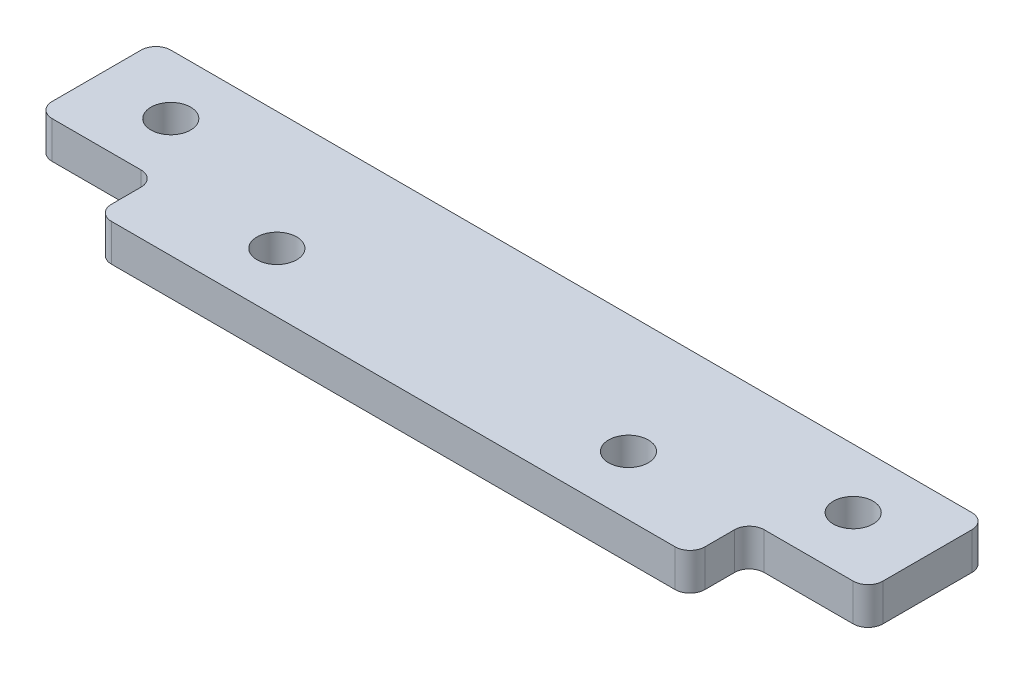
ISO-10303-21;
HEADER;
FILE_DESCRIPTION(('STEP AP214'),'2;1');
FILE_NAME('part.step','',(''),(''),'','','');
FILE_SCHEMA(('AUTOMOTIVE_DESIGN { 1 0 10303 214 1 1 1 1 }'));
ENDSEC;
DATA;
#1=APPLICATION_CONTEXT('core data for automotive mechanical design processes');
#2=APPLICATION_PROTOCOL_DEFINITION('international standard','automotive_design',2000,#1);
#3=PRODUCT_CONTEXT('',#1,'mechanical');
#4=PRODUCT('Part','Part','',(#3));
#5=PRODUCT_RELATED_PRODUCT_CATEGORY('part','',(#4));
#6=PRODUCT_DEFINITION_FORMATION('','',#4);
#7=PRODUCT_DEFINITION_CONTEXT('part definition',#1,'design');
#8=PRODUCT_DEFINITION('design','',#6,#7);
#9=PRODUCT_DEFINITION_SHAPE('','',#8);
#10=(LENGTH_UNIT() NAMED_UNIT(*) SI_UNIT(.MILLI.,.METRE.));
#11=(NAMED_UNIT(*) PLANE_ANGLE_UNIT() SI_UNIT($,.RADIAN.));
#12=(NAMED_UNIT(*) SI_UNIT($,.STERADIAN.) SOLID_ANGLE_UNIT());
#13=UNCERTAINTY_MEASURE_WITH_UNIT(LENGTH_MEASURE(1.E-05),#10,'distance_accuracy_value','');
#14=(GEOMETRIC_REPRESENTATION_CONTEXT(3) GLOBAL_UNCERTAINTY_ASSIGNED_CONTEXT((#13)) GLOBAL_UNIT_ASSIGNED_CONTEXT((#10,
#11,#12)) REPRESENTATION_CONTEXT('',''));
#15=CARTESIAN_POINT('',(0.,0.,0.));
#16=DIRECTION('',(0.,0.,1.));
#17=DIRECTION('',(1.,0.,0.));
#18=AXIS2_PLACEMENT_3D('',#15,#16,#17);
#19=CARTESIAN_POINT('',(0.,3.175,0.));
#20=DIRECTION('',(1.,0.,0.));
#21=DIRECTION('',(0.,0.,-1.));
#22=AXIS2_PLACEMENT_3D('',#19,#20,#21);
#23=PLANE('',#22);
#24=DIRECTION('',(0.,0.,1.));
#25=VECTOR('',#24,1.);
#26=CARTESIAN_POINT('',(0.,3.175,0.));
#27=LINE('',#26,#25);
#28=CARTESIAN_POINT('',(0.,3.175,-3.81));
#29=VERTEX_POINT('',#28);
#30=CARTESIAN_POINT('',(0.,3.175,-1.27));
#31=VERTEX_POINT('',#30);
#32=EDGE_CURVE('E185',#29,#31,#27,.T.);
#33=ORIENTED_EDGE('',*,*,#32,.F.);
#34=DIRECTION('',(0.,-1.,0.));
#35=VECTOR('',#34,1.);
#36=CARTESIAN_POINT('',(0.,0.,-3.81));
#37=LINE('',#36,#35);
#38=CARTESIAN_POINT('',(0.,0.,-3.81));
#39=VERTEX_POINT('',#38);
#40=EDGE_CURVE('E235',#29,#39,#37,.T.);
#41=ORIENTED_EDGE('',*,*,#40,.T.);
#42=DIRECTION('',(0.,0.,1.));
#43=VECTOR('',#42,1.);
#44=CARTESIAN_POINT('',(0.,0.,0.));
#45=LINE('',#44,#43);
#46=CARTESIAN_POINT('',(0.,0.,-1.27));
#47=VERTEX_POINT('',#46);
#48=EDGE_CURVE('E244',#39,#47,#45,.T.);
#49=ORIENTED_EDGE('',*,*,#48,.T.);
#50=DIRECTION('',(0.,-1.,0.));
#51=VECTOR('',#50,1.);
#52=CARTESIAN_POINT('',(0.,3.175,-1.27));
#53=LINE('',#52,#51);
#54=EDGE_CURVE('E233',#47,#31,#53,.F.);
#55=ORIENTED_EDGE('',*,*,#54,.T.);
#56=EDGE_LOOP('',(#33,#41,#49,#55));
#57=FACE_BOUND('',#56,.T.);
#58=ADVANCED_FACE('F33',(#57),#23,.F.);
#59=CARTESIAN_POINT('',(0.,3.175,0.));
#60=DIRECTION('',(0.,0.,-1.));
#61=DIRECTION('',(-1.,0.,0.));
#62=AXIS2_PLACEMENT_3D('',#59,#60,#61);
#63=PLANE('',#62);
#64=DIRECTION('',(1.,0.,0.));
#65=VECTOR('',#64,1.);
#66=CARTESIAN_POINT('',(0.,0.,0.));
#67=LINE('',#66,#65);
#68=CARTESIAN_POINT('',(1.27,0.,0.));
#69=VERTEX_POINT('',#68);
#70=CARTESIAN_POINT('',(49.53,0.,0.));
#71=VERTEX_POINT('',#70);
#72=EDGE_CURVE('E279',#69,#71,#67,.T.);
#73=ORIENTED_EDGE('',*,*,#72,.T.);
#74=DIRECTION('',(0.,-1.,0.));
#75=VECTOR('',#74,1.);
#76=CARTESIAN_POINT('',(49.53,3.175,0.));
#77=LINE('',#76,#75);
#78=CARTESIAN_POINT('',(49.53,3.175,0.));
#79=VERTEX_POINT('',#78);
#80=EDGE_CURVE('E222',#71,#79,#77,.F.);
#81=ORIENTED_EDGE('',*,*,#80,.T.);
#82=DIRECTION('',(1.,0.,0.));
#83=VECTOR('',#82,1.);
#84=CARTESIAN_POINT('',(0.,3.175,0.));
#85=LINE('',#84,#83);
#86=CARTESIAN_POINT('',(1.27,3.175,0.));
#87=VERTEX_POINT('',#86);
#88=EDGE_CURVE('E258',#87,#79,#85,.T.);
#89=ORIENTED_EDGE('',*,*,#88,.F.);
#90=DIRECTION('',(0.,-1.,0.));
#91=VECTOR('',#90,1.);
#92=CARTESIAN_POINT('',(1.27,3.175,0.));
#93=LINE('',#92,#91);
#94=EDGE_CURVE('E219',#87,#69,#93,.T.);
#95=ORIENTED_EDGE('',*,*,#94,.T.);
#96=EDGE_LOOP('',(#73,#81,#89,#95));
#97=FACE_BOUND('',#96,.T.);
#98=ADVANCED_FACE('F309',(#97),#63,.F.);
#99=CARTESIAN_POINT('',(50.8,3.175,0.));
#100=DIRECTION('',(-1.,0.,0.));
#101=DIRECTION('',(0.,0.,1.));
#102=AXIS2_PLACEMENT_3D('',#99,#100,#101);
#103=PLANE('',#102);
#104=DIRECTION('',(0.,0.,-1.));
#105=VECTOR('',#104,1.);
#106=CARTESIAN_POINT('',(50.8,0.,0.));
#107=LINE('',#106,#105);
#108=CARTESIAN_POINT('',(50.8,0.,-1.27));
#109=VERTEX_POINT('',#108);
#110=CARTESIAN_POINT('',(50.8,0.,-3.81));
#111=VERTEX_POINT('',#110);
#112=EDGE_CURVE('E282',#109,#111,#107,.T.);
#113=ORIENTED_EDGE('',*,*,#112,.T.);
#114=DIRECTION('',(0.,-1.,0.));
#115=VECTOR('',#114,1.);
#116=CARTESIAN_POINT('',(50.8,3.175,-3.81));
#117=LINE('',#116,#115);
#118=CARTESIAN_POINT('',(50.8,3.175,-3.81));
#119=VERTEX_POINT('',#118);
#120=EDGE_CURVE('E217',#111,#119,#117,.F.);
#121=ORIENTED_EDGE('',*,*,#120,.T.);
#122=DIRECTION('',(0.,0.,-1.));
#123=VECTOR('',#122,1.);
#124=CARTESIAN_POINT('',(50.8,3.175,0.));
#125=LINE('',#124,#123);
#126=CARTESIAN_POINT('',(50.8,3.175,-1.27));
#127=VERTEX_POINT('',#126);
#128=EDGE_CURVE('E261',#127,#119,#125,.T.);
#129=ORIENTED_EDGE('',*,*,#128,.F.);
#130=DIRECTION('',(0.,-1.,0.));
#131=VECTOR('',#130,1.);
#132=CARTESIAN_POINT('',(50.8,3.175,-1.27));
#133=LINE('',#132,#131);
#134=EDGE_CURVE('E214',#127,#109,#133,.T.);
#135=ORIENTED_EDGE('',*,*,#134,.T.);
#136=EDGE_LOOP('',(#113,#121,#129,#135));
#137=FACE_BOUND('',#136,.T.);
#138=ADVANCED_FACE('F306',(#137),#103,.F.);
#139=CARTESIAN_POINT('',(50.8,3.175,-5.08));
#140=DIRECTION('',(0.,0.,-1.));
#141=DIRECTION('',(-1.,0.,0.));
#142=AXIS2_PLACEMENT_3D('',#139,#140,#141);
#143=PLANE('',#142);
#144=DIRECTION('',(1.,0.,0.));
#145=VECTOR('',#144,1.);
#146=CARTESIAN_POINT('',(50.8,0.,-5.08));
#147=LINE('',#146,#145);
#148=CARTESIAN_POINT('',(52.07,0.,-5.08));
#149=VERTEX_POINT('',#148);
#150=CARTESIAN_POINT('',(59.69,0.,-5.08));
#151=VERTEX_POINT('',#150);
#152=EDGE_CURVE('E180',#149,#151,#147,.T.);
#153=ORIENTED_EDGE('',*,*,#152,.T.);
#154=DIRECTION('',(0.,-1.,0.));
#155=VECTOR('',#154,1.);
#156=CARTESIAN_POINT('',(59.69,3.175,-5.08));
#157=LINE('',#156,#155);
#158=CARTESIAN_POINT('',(59.69,3.175,-5.08));
#159=VERTEX_POINT('',#158);
#160=EDGE_CURVE('E212',#151,#159,#157,.F.);
#161=ORIENTED_EDGE('',*,*,#160,.T.);
#162=DIRECTION('',(1.,0.,0.));
#163=VECTOR('',#162,1.);
#164=CARTESIAN_POINT('',(50.8,3.175,-5.08));
#165=LINE('',#164,#163);
#166=CARTESIAN_POINT('',(52.07,3.175,-5.08));
#167=VERTEX_POINT('',#166);
#168=EDGE_CURVE('E269',#167,#159,#165,.T.);
#169=ORIENTED_EDGE('',*,*,#168,.F.);
#170=DIRECTION('',(0.,-1.,0.));
#171=VECTOR('',#170,1.);
#172=CARTESIAN_POINT('',(52.07,0.,-5.08));
#173=LINE('',#172,#171);
#174=EDGE_CURVE('E209',#167,#149,#173,.T.);
#175=ORIENTED_EDGE('',*,*,#174,.T.);
#176=EDGE_LOOP('',(#153,#161,#169,#175));
#177=FACE_BOUND('',#176,.T.);
#178=ADVANCED_FACE('F288',(#177),#143,.F.);
#179=CARTESIAN_POINT('',(60.96,3.175,-5.08));
#180=DIRECTION('',(-1.,0.,0.));
#181=DIRECTION('',(0.,0.,1.));
#182=AXIS2_PLACEMENT_3D('',#179,#180,#181);
#183=PLANE('',#182);
#184=DIRECTION('',(0.,0.,-1.));
#185=VECTOR('',#184,1.);
#186=CARTESIAN_POINT('',(60.96,0.,-5.08));
#187=LINE('',#186,#185);
#188=CARTESIAN_POINT('',(60.96,0.,-6.35));
#189=VERTEX_POINT('',#188);
#190=CARTESIAN_POINT('',(60.96,0.,-13.97));
#191=VERTEX_POINT('',#190);
#192=EDGE_CURVE('E175',#189,#191,#187,.T.);
#193=ORIENTED_EDGE('',*,*,#192,.T.);
#194=DIRECTION('',(0.,-1.,0.));
#195=VECTOR('',#194,1.);
#196=CARTESIAN_POINT('',(60.96,3.175,-13.97));
#197=LINE('',#196,#195);
#198=CARTESIAN_POINT('',(60.96,3.175,-13.97));
#199=VERTEX_POINT('',#198);
#200=EDGE_CURVE('E152',#191,#199,#197,.F.);
#201=ORIENTED_EDGE('',*,*,#200,.T.);
#202=DIRECTION('',(0.,0.,-1.));
#203=VECTOR('',#202,1.);
#204=CARTESIAN_POINT('',(60.96,3.175,-5.08));
#205=LINE('',#204,#203);
#206=CARTESIAN_POINT('',(60.96,3.175,-6.35));
#207=VERTEX_POINT('',#206);
#208=EDGE_CURVE('E272',#207,#199,#205,.T.);
#209=ORIENTED_EDGE('',*,*,#208,.F.);
#210=DIRECTION('',(0.,-1.,0.));
#211=VECTOR('',#210,1.);
#212=CARTESIAN_POINT('',(60.96,3.175,-6.35));
#213=LINE('',#212,#211);
#214=EDGE_CURVE('E157',#207,#189,#213,.T.);
#215=ORIENTED_EDGE('',*,*,#214,.T.);
#216=EDGE_LOOP('',(#193,#201,#209,#215));
#217=FACE_BOUND('',#216,.T.);
#218=ADVANCED_FACE('F297',(#217),#183,.F.);
#219=CARTESIAN_POINT('',(-10.16,3.175,-15.24));
#220=DIRECTION('',(0.,0.,1.));
#221=DIRECTION('',(1.,0.,0.));
#222=AXIS2_PLACEMENT_3D('',#219,#220,#221);
#223=PLANE('',#222);
#224=DIRECTION('',(-1.,0.,0.));
#225=VECTOR('',#224,1.);
#226=CARTESIAN_POINT('',(-10.16,3.175,-15.24));
#227=LINE('',#226,#225);
#228=CARTESIAN_POINT('',(59.69,3.175,-15.24));
#229=VERTEX_POINT('',#228);
#230=CARTESIAN_POINT('',(-8.89,3.175,-15.24));
#231=VERTEX_POINT('',#230);
#232=EDGE_CURVE('E167',#229,#231,#227,.T.);
#233=ORIENTED_EDGE('',*,*,#232,.F.);
#234=DIRECTION('',(0.,-1.,0.));
#235=VECTOR('',#234,1.);
#236=CARTESIAN_POINT('',(59.69,3.175,-15.24));
#237=LINE('',#236,#235);
#238=CARTESIAN_POINT('',(59.69,0.,-15.24));
#239=VERTEX_POINT('',#238);
#240=EDGE_CURVE('E151',#229,#239,#237,.T.);
#241=ORIENTED_EDGE('',*,*,#240,.T.);
#242=DIRECTION('',(-1.,0.,0.));
#243=VECTOR('',#242,1.);
#244=CARTESIAN_POINT('',(-10.16,0.,-15.24));
#245=LINE('',#244,#243);
#246=CARTESIAN_POINT('',(-8.89,0.,-15.24));
#247=VERTEX_POINT('',#246);
#248=EDGE_CURVE('E164',#239,#247,#245,.T.);
#249=ORIENTED_EDGE('',*,*,#248,.T.);
#250=DIRECTION('',(0.,-1.,0.));
#251=VECTOR('',#250,1.);
#252=CARTESIAN_POINT('',(-8.89,3.175,-15.24));
#253=LINE('',#252,#251);
#254=EDGE_CURVE('E169',#247,#231,#253,.F.);
#255=ORIENTED_EDGE('',*,*,#254,.T.);
#256=EDGE_LOOP('',(#233,#241,#249,#255));
#257=FACE_BOUND('',#256,.T.);
#258=ADVANCED_FACE('F163',(#257),#223,.F.);
#259=CARTESIAN_POINT('',(-10.16,3.175,-5.08));
#260=DIRECTION('',(1.,0.,0.));
#261=DIRECTION('',(0.,0.,-1.));
#262=AXIS2_PLACEMENT_3D('',#259,#260,#261);
#263=PLANE('',#262);
#264=DIRECTION('',(0.,0.,1.));
#265=VECTOR('',#264,1.);
#266=CARTESIAN_POINT('',(-10.16,3.175,-5.08));
#267=LINE('',#266,#265);
#268=CARTESIAN_POINT('',(-10.16,3.175,-13.97));
#269=VERTEX_POINT('',#268);
#270=CARTESIAN_POINT('',(-10.16,3.175,-6.35));
#271=VERTEX_POINT('',#270);
#272=EDGE_CURVE('E275',#269,#271,#267,.T.);
#273=ORIENTED_EDGE('',*,*,#272,.F.);
#274=DIRECTION('',(0.,-1.,0.));
#275=VECTOR('',#274,1.);
#276=CARTESIAN_POINT('',(-10.16,3.175,-13.97));
#277=LINE('',#276,#275);
#278=CARTESIAN_POINT('',(-10.16,0.,-13.97));
#279=VERTEX_POINT('',#278);
#280=EDGE_CURVE('E226',#269,#279,#277,.T.);
#281=ORIENTED_EDGE('',*,*,#280,.T.);
#282=DIRECTION('',(0.,0.,1.));
#283=VECTOR('',#282,1.);
#284=CARTESIAN_POINT('',(-10.16,0.,-5.08));
#285=LINE('',#284,#283);
#286=CARTESIAN_POINT('',(-10.16,0.,-6.35));
#287=VERTEX_POINT('',#286);
#288=EDGE_CURVE('E174',#279,#287,#285,.T.);
#289=ORIENTED_EDGE('',*,*,#288,.T.);
#290=DIRECTION('',(0.,-1.,0.));
#291=VECTOR('',#290,1.);
#292=CARTESIAN_POINT('',(-10.16,3.175,-6.35));
#293=LINE('',#292,#291);
#294=EDGE_CURVE('E224',#287,#271,#293,.F.);
#295=ORIENTED_EDGE('',*,*,#294,.T.);
#296=EDGE_LOOP('',(#273,#281,#289,#295));
#297=FACE_BOUND('',#296,.T.);
#298=ADVANCED_FACE('F304',(#297),#263,.F.);
#299=CARTESIAN_POINT('',(0.,3.175,-5.08));
#300=DIRECTION('',(0.,0.,-1.));
#301=DIRECTION('',(-1.,0.,0.));
#302=AXIS2_PLACEMENT_3D('',#299,#300,#301);
#303=PLANE('',#302);
#304=DIRECTION('',(1.,0.,0.));
#305=VECTOR('',#304,1.);
#306=CARTESIAN_POINT('',(0.,3.175,-5.08));
#307=LINE('',#306,#305);
#308=CARTESIAN_POINT('',(-8.89,3.175,-5.08));
#309=VERTEX_POINT('',#308);
#310=CARTESIAN_POINT('',(-1.27,3.175,-5.08));
#311=VERTEX_POINT('',#310);
#312=EDGE_CURVE('E186',#309,#311,#307,.T.);
#313=ORIENTED_EDGE('',*,*,#312,.F.);
#314=DIRECTION('',(0.,-1.,0.));
#315=VECTOR('',#314,1.);
#316=CARTESIAN_POINT('',(-8.89,3.175,-5.08));
#317=LINE('',#316,#315);
#318=CARTESIAN_POINT('',(-8.89,0.,-5.08));
#319=VERTEX_POINT('',#318);
#320=EDGE_CURVE('E230',#309,#319,#317,.T.);
#321=ORIENTED_EDGE('',*,*,#320,.T.);
#322=DIRECTION('',(1.,0.,0.));
#323=VECTOR('',#322,1.);
#324=CARTESIAN_POINT('',(0.,0.,-5.08));
#325=LINE('',#324,#323);
#326=CARTESIAN_POINT('',(-1.27,0.,-5.08));
#327=VERTEX_POINT('',#326);
#328=EDGE_CURVE('E178',#319,#327,#325,.T.);
#329=ORIENTED_EDGE('',*,*,#328,.T.);
#330=DIRECTION('',(0.,-1.,0.));
#331=VECTOR('',#330,1.);
#332=CARTESIAN_POINT('',(-1.27,3.175,-5.08));
#333=LINE('',#332,#331);
#334=EDGE_CURVE('E48',#327,#311,#333,.F.);
#335=ORIENTED_EDGE('',*,*,#334,.T.);
#336=EDGE_LOOP('',(#313,#321,#329,#335));
#337=FACE_BOUND('',#336,.T.);
#338=ADVANCED_FACE('F247',(#337),#303,.F.);
#339=CARTESIAN_POINT('',(0.,3.175,0.));
#340=DIRECTION('',(0.,1.,0.));
#341=DIRECTION('',(0.,0.,1.));
#342=AXIS2_PLACEMENT_3D('',#339,#340,#341);
#343=PLANE('',#342);
#344=CARTESIAN_POINT('',(-3.81,3.175,-10.16));
#345=DIRECTION('',(0.,1.,0.));
#346=DIRECTION('',(0.,0.,1.));
#347=AXIS2_PLACEMENT_3D('',#344,#345,#346);
#348=CIRCLE('',#347,1.69999999999999);
#349=CARTESIAN_POINT('',(-3.81,3.175,-8.46000000000002));
#350=VERTEX_POINT('',#349);
#351=EDGE_CURVE('E520',#350,#350,#348,.T.);
#352=ORIENTED_EDGE('',*,*,#351,.F.);
#353=EDGE_LOOP('',(#352));
#354=FACE_BOUND('',#353,.T.);
#355=CARTESIAN_POINT('',(10.3505,3.175,-5.08));
#356=DIRECTION('',(0.,1.,0.));
#357=DIRECTION('',(0.,0.,1.));
#358=AXIS2_PLACEMENT_3D('',#355,#356,#357);
#359=CIRCLE('',#358,1.69999999999999);
#360=CARTESIAN_POINT('',(10.3505,3.175,-3.38000000000001));
#361=VERTEX_POINT('',#360);
#362=EDGE_CURVE('E514',#361,#361,#359,.T.);
#363=ORIENTED_EDGE('',*,*,#362,.F.);
#364=EDGE_LOOP('',(#363));
#365=FACE_BOUND('',#364,.T.);
#366=CARTESIAN_POINT('',(40.4495,3.175,-5.08));
#367=DIRECTION('',(0.,1.,0.));
#368=DIRECTION('',(0.,0.,1.));
#369=AXIS2_PLACEMENT_3D('',#366,#367,#368);
#370=CIRCLE('',#369,1.69999999999999);
#371=CARTESIAN_POINT('',(40.4495,3.175,-3.38000000000001));
#372=VERTEX_POINT('',#371);
#373=EDGE_CURVE('E506',#372,#372,#370,.T.);
#374=ORIENTED_EDGE('',*,*,#373,.F.);
#375=EDGE_LOOP('',(#374));
#376=FACE_BOUND('',#375,.T.);
#377=CARTESIAN_POINT('',(54.61,3.175,-10.16));
#378=DIRECTION('',(0.,1.,0.));
#379=DIRECTION('',(0.,0.,1.));
#380=AXIS2_PLACEMENT_3D('',#377,#378,#379);
#381=CIRCLE('',#380,1.69999999999999);
#382=CARTESIAN_POINT('',(54.61,3.175,-8.46000000000002));
#383=VERTEX_POINT('',#382);
#384=EDGE_CURVE('E502',#383,#383,#381,.T.);
#385=ORIENTED_EDGE('',*,*,#384,.F.);
#386=EDGE_LOOP('',(#385));
#387=FACE_BOUND('',#386,.T.);
#388=ORIENTED_EDGE('',*,*,#208,.T.);
#389=CARTESIAN_POINT('',(59.69,3.175,-13.97));
#390=DIRECTION('',(0.,1.,0.));
#391=DIRECTION('',(0.,0.,1.));
#392=AXIS2_PLACEMENT_3D('',#389,#390,#391);
#393=CIRCLE('',#392,1.27);
#394=EDGE_CURVE('E207',#199,#229,#393,.T.);
#395=ORIENTED_EDGE('',*,*,#394,.T.);
#396=ORIENTED_EDGE('',*,*,#232,.T.);
#397=CARTESIAN_POINT('',(-8.89,3.175,-13.97));
#398=DIRECTION('',(0.,1.,0.));
#399=DIRECTION('',(0.,0.,1.));
#400=AXIS2_PLACEMENT_3D('',#397,#398,#399);
#401=CIRCLE('',#400,1.27);
#402=EDGE_CURVE('E201',#231,#269,#401,.T.);
#403=ORIENTED_EDGE('',*,*,#402,.T.);
#404=ORIENTED_EDGE('',*,*,#272,.T.);
#405=CARTESIAN_POINT('',(-8.89,3.175,-6.35));
#406=DIRECTION('',(0.,1.,0.));
#407=DIRECTION('',(0.,0.,1.));
#408=AXIS2_PLACEMENT_3D('',#405,#406,#407);
#409=CIRCLE('',#408,1.27);
#410=EDGE_CURVE('E55',#271,#309,#409,.T.);
#411=ORIENTED_EDGE('',*,*,#410,.T.);
#412=ORIENTED_EDGE('',*,*,#312,.T.);
#413=CARTESIAN_POINT('',(-1.27,3.175,-3.81));
#414=DIRECTION('',(0.,1.,0.));
#415=DIRECTION('',(0.,0.,1.));
#416=AXIS2_PLACEMENT_3D('',#413,#414,#415);
#417=CIRCLE('',#416,1.27);
#418=EDGE_CURVE('E11',#311,#29,#417,.F.);
#419=ORIENTED_EDGE('',*,*,#418,.T.);
#420=ORIENTED_EDGE('',*,*,#32,.T.);
#421=CARTESIAN_POINT('',(1.27,3.175,-1.27));
#422=DIRECTION('',(0.,1.,0.));
#423=DIRECTION('',(0.,0.,1.));
#424=AXIS2_PLACEMENT_3D('',#421,#422,#423);
#425=CIRCLE('',#424,1.27);
#426=EDGE_CURVE('E198',#31,#87,#425,.T.);
#427=ORIENTED_EDGE('',*,*,#426,.T.);
#428=ORIENTED_EDGE('',*,*,#88,.T.);
#429=CARTESIAN_POINT('',(49.53,3.175,-1.27));
#430=DIRECTION('',(0.,1.,0.));
#431=DIRECTION('',(0.,0.,1.));
#432=AXIS2_PLACEMENT_3D('',#429,#430,#431);
#433=CIRCLE('',#432,1.27);
#434=EDGE_CURVE('E203',#79,#127,#433,.T.);
#435=ORIENTED_EDGE('',*,*,#434,.T.);
#436=ORIENTED_EDGE('',*,*,#128,.T.);
#437=CARTESIAN_POINT('',(52.07,3.175,-3.81));
#438=DIRECTION('',(0.,1.,0.));
#439=DIRECTION('',(0.,0.,1.));
#440=AXIS2_PLACEMENT_3D('',#437,#438,#439);
#441=CIRCLE('',#440,1.27);
#442=EDGE_CURVE('E240',#119,#167,#441,.F.);
#443=ORIENTED_EDGE('',*,*,#442,.T.);
#444=ORIENTED_EDGE('',*,*,#168,.T.);
#445=CARTESIAN_POINT('',(59.69,3.175,-6.35));
#446=DIRECTION('',(0.,1.,0.));
#447=DIRECTION('',(0.,0.,1.));
#448=AXIS2_PLACEMENT_3D('',#445,#446,#447);
#449=CIRCLE('',#448,1.27);
#450=EDGE_CURVE('E205',#159,#207,#449,.T.);
#451=ORIENTED_EDGE('',*,*,#450,.T.);
#452=EDGE_LOOP('',(#388,#395,#396,#403,#404,#411,#412,#419,#420,#427,#428,#435,#436,#443,#444,#451));
#453=FACE_BOUND('',#452,.T.);
#454=ADVANCED_FACE('F254',(#354,#365,#376,#387,#453),#343,.T.);
#455=CARTESIAN_POINT('',(0.,0.,0.));
#456=DIRECTION('',(0.,1.,0.));
#457=DIRECTION('',(0.,0.,1.));
#458=AXIS2_PLACEMENT_3D('',#455,#456,#457);
#459=PLANE('',#458);
#460=CARTESIAN_POINT('',(-3.81,0.,-10.16));
#461=DIRECTION('',(0.,1.,0.));
#462=DIRECTION('',(0.,0.,1.));
#463=AXIS2_PLACEMENT_3D('',#460,#461,#462);
#464=CIRCLE('',#463,1.7);
#465=CARTESIAN_POINT('',(-3.81,0.,-8.46));
#466=VERTEX_POINT('',#465);
#467=EDGE_CURVE('E517',#466,#466,#464,.T.);
#468=ORIENTED_EDGE('',*,*,#467,.T.);
#469=EDGE_LOOP('',(#468));
#470=FACE_BOUND('',#469,.T.);
#471=CARTESIAN_POINT('',(10.3505,0.,-5.08));
#472=DIRECTION('',(0.,1.,0.));
#473=DIRECTION('',(0.,0.,1.));
#474=AXIS2_PLACEMENT_3D('',#471,#472,#473);
#475=CIRCLE('',#474,1.7);
#476=CARTESIAN_POINT('',(10.3505,0.,-3.38));
#477=VERTEX_POINT('',#476);
#478=EDGE_CURVE('E511',#477,#477,#475,.T.);
#479=ORIENTED_EDGE('',*,*,#478,.T.);
#480=EDGE_LOOP('',(#479));
#481=FACE_BOUND('',#480,.T.);
#482=CARTESIAN_POINT('',(40.4495,0.,-5.08));
#483=DIRECTION('',(0.,1.,0.));
#484=DIRECTION('',(0.,0.,1.));
#485=AXIS2_PLACEMENT_3D('',#482,#483,#484);
#486=CIRCLE('',#485,1.7);
#487=CARTESIAN_POINT('',(40.4495,0.,-3.38));
#488=VERTEX_POINT('',#487);
#489=EDGE_CURVE('E504',#488,#488,#486,.T.);
#490=ORIENTED_EDGE('',*,*,#489,.T.);
#491=EDGE_LOOP('',(#490));
#492=FACE_BOUND('',#491,.T.);
#493=CARTESIAN_POINT('',(54.61,0.,-10.16));
#494=DIRECTION('',(0.,1.,0.));
#495=DIRECTION('',(0.,0.,1.));
#496=AXIS2_PLACEMENT_3D('',#493,#494,#495);
#497=CIRCLE('',#496,1.7);
#498=CARTESIAN_POINT('',(54.61,0.,-8.46));
#499=VERTEX_POINT('',#498);
#500=EDGE_CURVE('E264',#499,#499,#497,.T.);
#501=ORIENTED_EDGE('',*,*,#500,.T.);
#502=EDGE_LOOP('',(#501));
#503=FACE_BOUND('',#502,.T.);
#504=ORIENTED_EDGE('',*,*,#248,.F.);
#505=CARTESIAN_POINT('',(59.69,0.,-13.97));
#506=DIRECTION('',(0.,1.,0.));
#507=DIRECTION('',(0.,0.,1.));
#508=AXIS2_PLACEMENT_3D('',#505,#506,#507);
#509=CIRCLE('',#508,1.27);
#510=EDGE_CURVE('E147',#239,#191,#509,.F.);
#511=ORIENTED_EDGE('',*,*,#510,.T.);
#512=ORIENTED_EDGE('',*,*,#192,.F.);
#513=CARTESIAN_POINT('',(59.69,0.,-6.35));
#514=DIRECTION('',(0.,1.,0.));
#515=DIRECTION('',(0.,0.,1.));
#516=AXIS2_PLACEMENT_3D('',#513,#514,#515);
#517=CIRCLE('',#516,1.27);
#518=EDGE_CURVE('E158',#189,#151,#517,.F.);
#519=ORIENTED_EDGE('',*,*,#518,.T.);
#520=ORIENTED_EDGE('',*,*,#152,.F.);
#521=CARTESIAN_POINT('',(52.07,0.,-3.81));
#522=DIRECTION('',(0.,1.,0.));
#523=DIRECTION('',(0.,0.,1.));
#524=AXIS2_PLACEMENT_3D('',#521,#522,#523);
#525=CIRCLE('',#524,1.27);
#526=EDGE_CURVE('E238',#149,#111,#525,.T.);
#527=ORIENTED_EDGE('',*,*,#526,.T.);
#528=ORIENTED_EDGE('',*,*,#112,.F.);
#529=CARTESIAN_POINT('',(49.53,0.,-1.27));
#530=DIRECTION('',(0.,1.,0.));
#531=DIRECTION('',(0.,0.,1.));
#532=AXIS2_PLACEMENT_3D('',#529,#530,#531);
#533=CIRCLE('',#532,1.27);
#534=EDGE_CURVE('E192',#109,#71,#533,.F.);
#535=ORIENTED_EDGE('',*,*,#534,.T.);
#536=ORIENTED_EDGE('',*,*,#72,.F.);
#537=CARTESIAN_POINT('',(1.27,0.,-1.27));
#538=DIRECTION('',(0.,1.,0.));
#539=DIRECTION('',(0.,0.,1.));
#540=AXIS2_PLACEMENT_3D('',#537,#538,#539);
#541=CIRCLE('',#540,1.27);
#542=EDGE_CURVE('E168',#69,#47,#541,.F.);
#543=ORIENTED_EDGE('',*,*,#542,.T.);
#544=ORIENTED_EDGE('',*,*,#48,.F.);
#545=CARTESIAN_POINT('',(-1.27,0.,-3.81));
#546=DIRECTION('',(0.,1.,0.));
#547=DIRECTION('',(0.,0.,1.));
#548=AXIS2_PLACEMENT_3D('',#545,#546,#547);
#549=CIRCLE('',#548,1.27);
#550=EDGE_CURVE('E41',#39,#327,#549,.T.);
#551=ORIENTED_EDGE('',*,*,#550,.T.);
#552=ORIENTED_EDGE('',*,*,#328,.F.);
#553=CARTESIAN_POINT('',(-8.89,0.,-6.35));
#554=DIRECTION('',(0.,1.,0.));
#555=DIRECTION('',(0.,0.,1.));
#556=AXIS2_PLACEMENT_3D('',#553,#554,#555);
#557=CIRCLE('',#556,1.27);
#558=EDGE_CURVE('E189',#319,#287,#557,.F.);
#559=ORIENTED_EDGE('',*,*,#558,.T.);
#560=ORIENTED_EDGE('',*,*,#288,.F.);
#561=CARTESIAN_POINT('',(-8.89,0.,-13.97));
#562=DIRECTION('',(0.,1.,0.));
#563=DIRECTION('',(0.,0.,1.));
#564=AXIS2_PLACEMENT_3D('',#561,#562,#563);
#565=CIRCLE('',#564,1.27);
#566=EDGE_CURVE('E173',#279,#247,#565,.F.);
#567=ORIENTED_EDGE('',*,*,#566,.T.);
#568=EDGE_LOOP('',(#504,#511,#512,#519,#520,#527,#528,#535,#536,#543,#544,#551,#552,#559,#560,#567));
#569=FACE_BOUND('',#568,.T.);
#570=ADVANCED_FACE('F171',(#470,#481,#492,#503,#569),#459,.F.);
#571=CARTESIAN_POINT('',(54.61,3.175,-10.16));
#572=DIRECTION('',(0.,1.,0.));
#573=DIRECTION('',(0.,0.,1.));
#574=AXIS2_PLACEMENT_3D('',#571,#572,#573);
#575=CYLINDRICAL_SURFACE('',#574,1.69999999999999);
#576=ORIENTED_EDGE('',*,*,#500,.F.);
#577=EDGE_LOOP('',(#576));
#578=FACE_BOUND('',#577,.T.);
#579=ORIENTED_EDGE('',*,*,#384,.T.);
#580=EDGE_LOOP('',(#579));
#581=FACE_BOUND('',#580,.T.);
#582=ADVANCED_FACE('F410',(#578,#581),#575,.F.);
#583=CARTESIAN_POINT('',(40.4495,3.175,-5.08));
#584=DIRECTION('',(0.,1.,0.));
#585=DIRECTION('',(0.,0.,1.));
#586=AXIS2_PLACEMENT_3D('',#583,#584,#585);
#587=CYLINDRICAL_SURFACE('',#586,1.69999999999999);
#588=ORIENTED_EDGE('',*,*,#489,.F.);
#589=EDGE_LOOP('',(#588));
#590=FACE_BOUND('',#589,.T.);
#591=ORIENTED_EDGE('',*,*,#373,.T.);
#592=EDGE_LOOP('',(#591));
#593=FACE_BOUND('',#592,.T.);
#594=ADVANCED_FACE('F473',(#590,#593),#587,.F.);
#595=CARTESIAN_POINT('',(10.3505,3.175,-5.08));
#596=DIRECTION('',(0.,1.,0.));
#597=DIRECTION('',(0.,0.,1.));
#598=AXIS2_PLACEMENT_3D('',#595,#596,#597);
#599=CYLINDRICAL_SURFACE('',#598,1.69999999999999);
#600=ORIENTED_EDGE('',*,*,#478,.F.);
#601=EDGE_LOOP('',(#600));
#602=FACE_BOUND('',#601,.T.);
#603=ORIENTED_EDGE('',*,*,#362,.T.);
#604=EDGE_LOOP('',(#603));
#605=FACE_BOUND('',#604,.T.);
#606=ADVANCED_FACE('F466',(#602,#605),#599,.F.);
#607=CARTESIAN_POINT('',(-3.81,3.175,-10.16));
#608=DIRECTION('',(0.,1.,0.));
#609=DIRECTION('',(0.,0.,1.));
#610=AXIS2_PLACEMENT_3D('',#607,#608,#609);
#611=CYLINDRICAL_SURFACE('',#610,1.69999999999999);
#612=ORIENTED_EDGE('',*,*,#467,.F.);
#613=EDGE_LOOP('',(#612));
#614=FACE_BOUND('',#613,.T.);
#615=ORIENTED_EDGE('',*,*,#351,.T.);
#616=EDGE_LOOP('',(#615));
#617=FACE_BOUND('',#616,.T.);
#618=ADVANCED_FACE('F320',(#614,#617),#611,.F.);
#619=CARTESIAN_POINT('',(59.69,3.175,-13.97));
#620=DIRECTION('',(0.,-1.,0.));
#621=DIRECTION('',(0.,0.,-1.));
#622=AXIS2_PLACEMENT_3D('',#619,#620,#621);
#623=CYLINDRICAL_SURFACE('',#622,1.27);
#624=ORIENTED_EDGE('',*,*,#394,.F.);
#625=ORIENTED_EDGE('',*,*,#200,.F.);
#626=ORIENTED_EDGE('',*,*,#510,.F.);
#627=ORIENTED_EDGE('',*,*,#240,.F.);
#628=EDGE_LOOP('',(#624,#625,#626,#627));
#629=FACE_BOUND('',#628,.T.);
#630=ADVANCED_FACE('F150',(#629),#623,.T.);
#631=CARTESIAN_POINT('',(59.69,3.175,-6.35));
#632=DIRECTION('',(0.,-1.,0.));
#633=DIRECTION('',(0.,0.,-1.));
#634=AXIS2_PLACEMENT_3D('',#631,#632,#633);
#635=CYLINDRICAL_SURFACE('',#634,1.27);
#636=ORIENTED_EDGE('',*,*,#450,.F.);
#637=ORIENTED_EDGE('',*,*,#160,.F.);
#638=ORIENTED_EDGE('',*,*,#518,.F.);
#639=ORIENTED_EDGE('',*,*,#214,.F.);
#640=EDGE_LOOP('',(#636,#637,#638,#639));
#641=FACE_BOUND('',#640,.T.);
#642=ADVANCED_FACE('F293',(#641),#635,.T.);
#643=CARTESIAN_POINT('',(52.07,3.175,-3.81));
#644=DIRECTION('',(0.,1.,0.));
#645=DIRECTION('',(0.,0.,1.));
#646=AXIS2_PLACEMENT_3D('',#643,#644,#645);
#647=CYLINDRICAL_SURFACE('',#646,1.27);
#648=ORIENTED_EDGE('',*,*,#442,.F.);
#649=ORIENTED_EDGE('',*,*,#120,.F.);
#650=ORIENTED_EDGE('',*,*,#526,.F.);
#651=ORIENTED_EDGE('',*,*,#174,.F.);
#652=EDGE_LOOP('',(#648,#649,#650,#651));
#653=FACE_BOUND('',#652,.T.);
#654=ADVANCED_FACE('F323',(#653),#647,.F.);
#655=CARTESIAN_POINT('',(49.53,3.175,-1.27));
#656=DIRECTION('',(0.,-1.,0.));
#657=DIRECTION('',(0.,0.,-1.));
#658=AXIS2_PLACEMENT_3D('',#655,#656,#657);
#659=CYLINDRICAL_SURFACE('',#658,1.27);
#660=ORIENTED_EDGE('',*,*,#434,.F.);
#661=ORIENTED_EDGE('',*,*,#80,.F.);
#662=ORIENTED_EDGE('',*,*,#534,.F.);
#663=ORIENTED_EDGE('',*,*,#134,.F.);
#664=EDGE_LOOP('',(#660,#661,#662,#663));
#665=FACE_BOUND('',#664,.T.);
#666=ADVANCED_FACE('F326',(#665),#659,.T.);
#667=CARTESIAN_POINT('',(-8.89,3.175,-13.97));
#668=DIRECTION('',(0.,-1.,0.));
#669=DIRECTION('',(0.,0.,-1.));
#670=AXIS2_PLACEMENT_3D('',#667,#668,#669);
#671=CYLINDRICAL_SURFACE('',#670,1.27);
#672=ORIENTED_EDGE('',*,*,#402,.F.);
#673=ORIENTED_EDGE('',*,*,#254,.F.);
#674=ORIENTED_EDGE('',*,*,#566,.F.);
#675=ORIENTED_EDGE('',*,*,#280,.F.);
#676=EDGE_LOOP('',(#672,#673,#674,#675));
#677=FACE_BOUND('',#676,.T.);
#678=ADVANCED_FACE('F330',(#677),#671,.T.);
#679=CARTESIAN_POINT('',(-8.89,3.175,-6.35));
#680=DIRECTION('',(0.,-1.,0.));
#681=DIRECTION('',(0.,0.,-1.));
#682=AXIS2_PLACEMENT_3D('',#679,#680,#681);
#683=CYLINDRICAL_SURFACE('',#682,1.27);
#684=ORIENTED_EDGE('',*,*,#410,.F.);
#685=ORIENTED_EDGE('',*,*,#294,.F.);
#686=ORIENTED_EDGE('',*,*,#558,.F.);
#687=ORIENTED_EDGE('',*,*,#320,.F.);
#688=EDGE_LOOP('',(#684,#685,#686,#687));
#689=FACE_BOUND('',#688,.T.);
#690=ADVANCED_FACE('F334',(#689),#683,.T.);
#691=CARTESIAN_POINT('',(-1.27,3.175,-3.81));
#692=DIRECTION('',(0.,1.,0.));
#693=DIRECTION('',(0.,0.,1.));
#694=AXIS2_PLACEMENT_3D('',#691,#692,#693);
#695=CYLINDRICAL_SURFACE('',#694,1.27);
#696=ORIENTED_EDGE('',*,*,#418,.F.);
#697=ORIENTED_EDGE('',*,*,#334,.F.);
#698=ORIENTED_EDGE('',*,*,#550,.F.);
#699=ORIENTED_EDGE('',*,*,#40,.F.);
#700=EDGE_LOOP('',(#696,#697,#698,#699));
#701=FACE_BOUND('',#700,.T.);
#702=ADVANCED_FACE('F250',(#701),#695,.F.);
#703=CARTESIAN_POINT('',(1.27,3.175,-1.27));
#704=DIRECTION('',(0.,-1.,0.));
#705=DIRECTION('',(0.,0.,-1.));
#706=AXIS2_PLACEMENT_3D('',#703,#704,#705);
#707=CYLINDRICAL_SURFACE('',#706,1.27);
#708=ORIENTED_EDGE('',*,*,#426,.F.);
#709=ORIENTED_EDGE('',*,*,#54,.F.);
#710=ORIENTED_EDGE('',*,*,#542,.F.);
#711=ORIENTED_EDGE('',*,*,#94,.F.);
#712=EDGE_LOOP('',(#708,#709,#710,#711));
#713=FACE_BOUND('',#712,.T.);
#714=ADVANCED_FACE('F35',(#713),#707,.T.);
#715=CLOSED_SHELL('',(#58,#98,#138,#178,#218,#258,#298,#338,#454,#570,#582,#594,#606,#618,#630,
#642,#654,#666,#678,#690,#702,#714));
#716=MANIFOLD_SOLID_BREP('B2',#715);
#717=ADVANCED_BREP_SHAPE_REPRESENTATION('',(#18,#716),#14);
#718=SHAPE_DEFINITION_REPRESENTATION(#9,#717);
ENDSEC;
END-ISO-10303-21;
